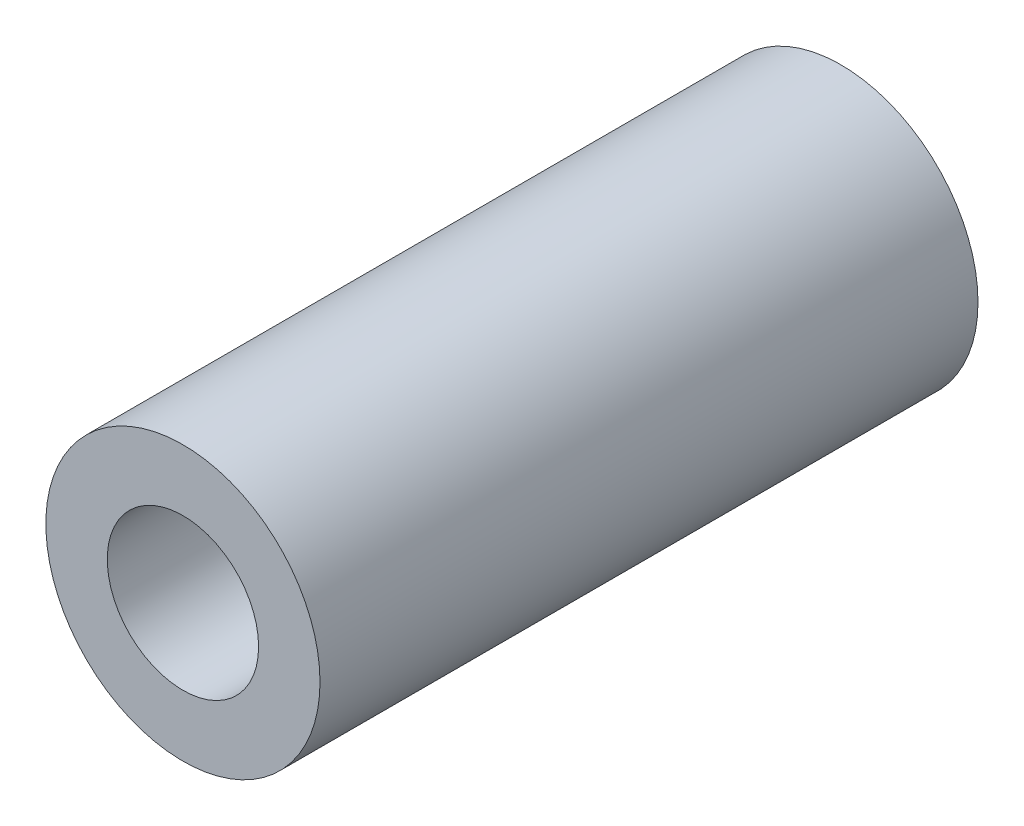
ISO-10303-21;
HEADER;
FILE_DESCRIPTION(('STEP AP214'),'2;1');
FILE_NAME('part.step','',(''),(''),'','','');
FILE_SCHEMA(('AUTOMOTIVE_DESIGN { 1 0 10303 214 1 1 1 1 }'));
ENDSEC;
DATA;
#1=APPLICATION_CONTEXT('core data for automotive mechanical design processes');
#2=APPLICATION_PROTOCOL_DEFINITION('international standard','automotive_design',2000,#1);
#3=PRODUCT_CONTEXT('',#1,'mechanical');
#4=PRODUCT('Part','Part','',(#3));
#5=PRODUCT_RELATED_PRODUCT_CATEGORY('part','',(#4));
#6=PRODUCT_DEFINITION_FORMATION('','',#4);
#7=PRODUCT_DEFINITION_CONTEXT('part definition',#1,'design');
#8=PRODUCT_DEFINITION('design','',#6,#7);
#9=PRODUCT_DEFINITION_SHAPE('','',#8);
#10=(LENGTH_UNIT() NAMED_UNIT(*) SI_UNIT(.MILLI.,.METRE.));
#11=(NAMED_UNIT(*) PLANE_ANGLE_UNIT() SI_UNIT($,.RADIAN.));
#12=(NAMED_UNIT(*) SI_UNIT($,.STERADIAN.) SOLID_ANGLE_UNIT());
#13=UNCERTAINTY_MEASURE_WITH_UNIT(LENGTH_MEASURE(1.E-05),#10,'distance_accuracy_value','');
#14=(GEOMETRIC_REPRESENTATION_CONTEXT(3) GLOBAL_UNCERTAINTY_ASSIGNED_CONTEXT((#13)) GLOBAL_UNIT_ASSIGNED_CONTEXT((#10,
#11,#12)) REPRESENTATION_CONTEXT('',''));
#15=CARTESIAN_POINT('',(0.,0.,0.));
#16=DIRECTION('',(0.,0.,1.));
#17=DIRECTION('',(1.,0.,0.));
#18=AXIS2_PLACEMENT_3D('',#15,#16,#17);
#19=CARTESIAN_POINT('',(0.,0.,22.86));
#20=DIRECTION('',(0.,0.,1.));
#21=DIRECTION('',(1.,0.,0.));
#22=AXIS2_PLACEMENT_3D('',#19,#20,#21);
#23=PLANE('',#22);
#24=CARTESIAN_POINT('',(0.,0.,22.86));
#25=DIRECTION('',(0.,0.,1.));
#26=DIRECTION('',(1.,0.,0.));
#27=AXIS2_PLACEMENT_3D('',#24,#25,#26);
#28=CIRCLE('',#27,4.7625);
#29=CARTESIAN_POINT('',(4.7625,0.,22.86));
#30=VERTEX_POINT('',#29);
#31=EDGE_CURVE('E10',#30,#30,#28,.T.);
#32=ORIENTED_EDGE('',*,*,#31,.T.);
#33=EDGE_LOOP('',(#32));
#34=FACE_BOUND('',#33,.T.);
#35=CARTESIAN_POINT('',(0.,0.,22.86));
#36=DIRECTION('',(0.,0.,1.));
#37=DIRECTION('',(1.,0.,0.));
#38=AXIS2_PLACEMENT_3D('',#35,#36,#37);
#39=CIRCLE('',#38,2.6289);
#40=CARTESIAN_POINT('',(2.6289,0.,22.86));
#41=VERTEX_POINT('',#40);
#42=EDGE_CURVE('E42',#41,#41,#39,.T.);
#43=ORIENTED_EDGE('',*,*,#42,.F.);
#44=EDGE_LOOP('',(#43));
#45=FACE_BOUND('',#44,.T.);
#46=ADVANCED_FACE('F31',(#34,#45),#23,.T.);
#47=CARTESIAN_POINT('',(0.,0.,0.));
#48=DIRECTION('',(0.,0.,1.));
#49=DIRECTION('',(1.,0.,0.));
#50=AXIS2_PLACEMENT_3D('',#47,#48,#49);
#51=PLANE('',#50);
#52=CARTESIAN_POINT('',(0.,0.,0.));
#53=DIRECTION('',(0.,0.,1.));
#54=DIRECTION('',(1.,0.,0.));
#55=AXIS2_PLACEMENT_3D('',#52,#53,#54);
#56=CIRCLE('',#55,4.7625);
#57=CARTESIAN_POINT('',(4.7625,0.,0.));
#58=VERTEX_POINT('',#57);
#59=EDGE_CURVE('E35',#58,#58,#56,.T.);
#60=ORIENTED_EDGE('',*,*,#59,.F.);
#61=EDGE_LOOP('',(#60));
#62=FACE_BOUND('',#61,.T.);
#63=CARTESIAN_POINT('',(0.,0.,0.));
#64=DIRECTION('',(0.,0.,1.));
#65=DIRECTION('',(1.,0.,0.));
#66=AXIS2_PLACEMENT_3D('',#63,#64,#65);
#67=CIRCLE('',#66,2.6289);
#68=CARTESIAN_POINT('',(2.6289,0.,0.));
#69=VERTEX_POINT('',#68);
#70=EDGE_CURVE('E44',#69,#69,#67,.T.);
#71=ORIENTED_EDGE('',*,*,#70,.T.);
#72=EDGE_LOOP('',(#71));
#73=FACE_BOUND('',#72,.T.);
#74=ADVANCED_FACE('F54',(#62,#73),#51,.F.);
#75=CARTESIAN_POINT('',(0.,0.,22.86));
#76=DIRECTION('',(0.,0.,-1.));
#77=DIRECTION('',(-1.,0.,0.));
#78=AXIS2_PLACEMENT_3D('',#75,#76,#77);
#79=CYLINDRICAL_SURFACE('',#78,4.7625);
#80=ORIENTED_EDGE('',*,*,#31,.F.);
#81=EDGE_LOOP('',(#80));
#82=FACE_BOUND('',#81,.T.);
#83=ORIENTED_EDGE('',*,*,#59,.T.);
#84=EDGE_LOOP('',(#83));
#85=FACE_BOUND('',#84,.T.);
#86=ADVANCED_FACE('F33',(#82,#85),#79,.T.);
#87=CARTESIAN_POINT('',(0.,0.,22.86));
#88=DIRECTION('',(0.,0.,-1.));
#89=DIRECTION('',(-1.,0.,0.));
#90=AXIS2_PLACEMENT_3D('',#87,#88,#89);
#91=CYLINDRICAL_SURFACE('',#90,2.6289);
#92=ORIENTED_EDGE('',*,*,#42,.T.);
#93=EDGE_LOOP('',(#92));
#94=FACE_BOUND('',#93,.T.);
#95=ORIENTED_EDGE('',*,*,#70,.F.);
#96=EDGE_LOOP('',(#95));
#97=FACE_BOUND('',#96,.T.);
#98=ADVANCED_FACE('F50',(#94,#97),#91,.F.);
#99=CLOSED_SHELL('',(#46,#74,#86,#98));
#100=MANIFOLD_SOLID_BREP('B2',#99);
#101=ADVANCED_BREP_SHAPE_REPRESENTATION('',(#18,#100),#14);
#102=SHAPE_DEFINITION_REPRESENTATION(#9,#101);
ENDSEC;
END-ISO-10303-21;
